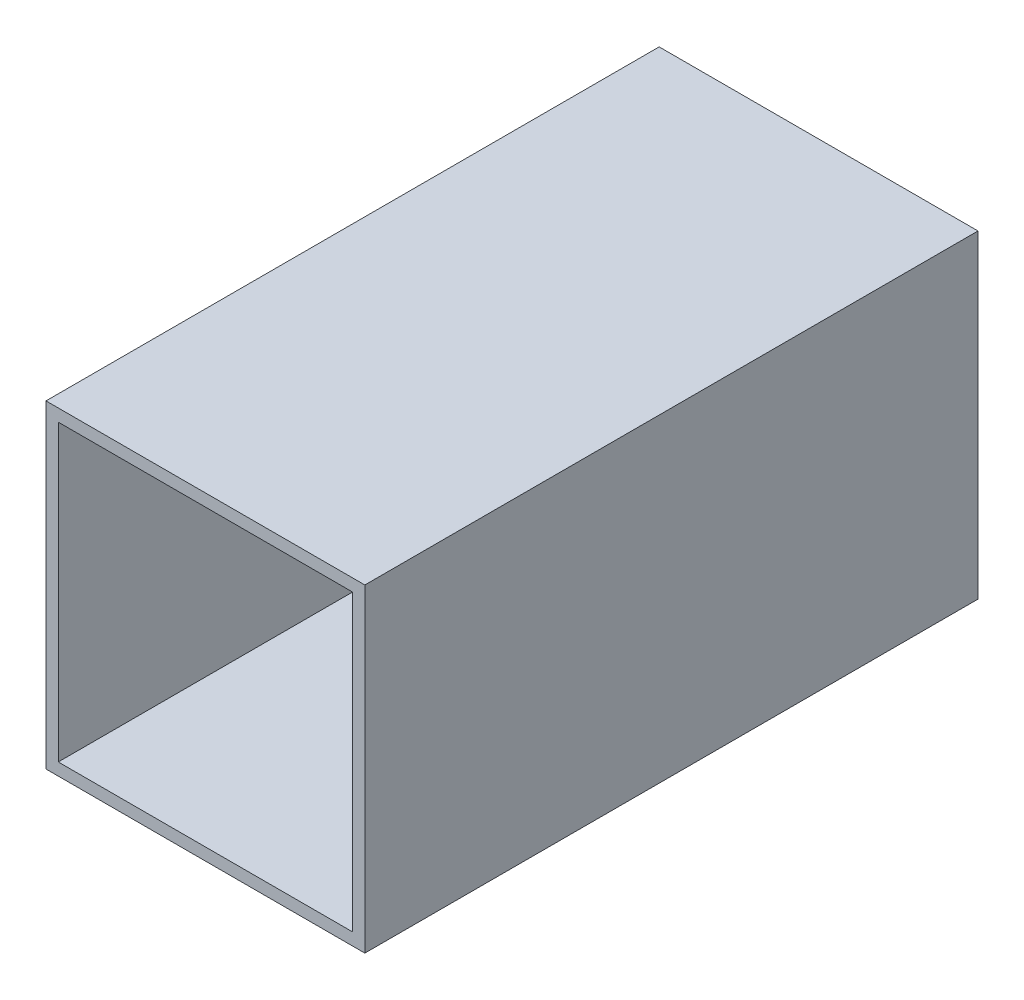
ISO-10303-21;
HEADER;
FILE_DESCRIPTION(('STEP AP214'),'2;1');
FILE_NAME('part.step','',(''),(''),'','','');
FILE_SCHEMA(('AUTOMOTIVE_DESIGN { 1 0 10303 214 1 1 1 1 }'));
ENDSEC;
DATA;
#1=APPLICATION_CONTEXT('core data for automotive mechanical design processes');
#2=APPLICATION_PROTOCOL_DEFINITION('international standard','automotive_design',2000,#1);
#3=PRODUCT_CONTEXT('',#1,'mechanical');
#4=PRODUCT('Part','Part','',(#3));
#5=PRODUCT_RELATED_PRODUCT_CATEGORY('part','',(#4));
#6=PRODUCT_DEFINITION_FORMATION('','',#4);
#7=PRODUCT_DEFINITION_CONTEXT('part definition',#1,'design');
#8=PRODUCT_DEFINITION('design','',#6,#7);
#9=PRODUCT_DEFINITION_SHAPE('','',#8);
#10=(LENGTH_UNIT() NAMED_UNIT(*) SI_UNIT(.MILLI.,.METRE.));
#11=(NAMED_UNIT(*) PLANE_ANGLE_UNIT() SI_UNIT($,.RADIAN.));
#12=(NAMED_UNIT(*) SI_UNIT($,.STERADIAN.) SOLID_ANGLE_UNIT());
#13=UNCERTAINTY_MEASURE_WITH_UNIT(LENGTH_MEASURE(1.E-05),#10,'distance_accuracy_value','');
#14=(GEOMETRIC_REPRESENTATION_CONTEXT(3) GLOBAL_UNCERTAINTY_ASSIGNED_CONTEXT((#13)) GLOBAL_UNIT_ASSIGNED_CONTEXT((#10,
#11,#12)) REPRESENTATION_CONTEXT('',''));
#15=CARTESIAN_POINT('',(0.,0.,0.));
#16=DIRECTION('',(0.,0.,1.));
#17=DIRECTION('',(1.,0.,0.));
#18=AXIS2_PLACEMENT_3D('',#15,#16,#17);
#19=CARTESIAN_POINT('',(0.,0.,152.4));
#20=DIRECTION('',(0.,0.,1.));
#21=DIRECTION('',(1.,0.,0.));
#22=AXIS2_PLACEMENT_3D('',#19,#20,#21);
#23=PLANE('',#22);
#24=DIRECTION('',(0.,-1.,0.));
#25=VECTOR('',#24,1.);
#26=CARTESIAN_POINT('',(-39.624,-39.624,152.4));
#27=LINE('',#26,#25);
#28=CARTESIAN_POINT('',(-39.624,39.624,152.4));
#29=VERTEX_POINT('',#28);
#30=CARTESIAN_POINT('',(-39.624,-39.624,152.4));
#31=VERTEX_POINT('',#30);
#32=EDGE_CURVE('E133',#29,#31,#27,.T.);
#33=ORIENTED_EDGE('',*,*,#32,.T.);
#34=DIRECTION('',(1.,0.,0.));
#35=VECTOR('',#34,1.);
#36=CARTESIAN_POINT('',(39.624,-39.624,152.4));
#37=LINE('',#36,#35);
#38=CARTESIAN_POINT('',(39.624,-39.624,152.4));
#39=VERTEX_POINT('',#38);
#40=EDGE_CURVE('E136',#31,#39,#37,.T.);
#41=ORIENTED_EDGE('',*,*,#40,.T.);
#42=DIRECTION('',(0.,1.,0.));
#43=VECTOR('',#42,1.);
#44=CARTESIAN_POINT('',(39.624,-39.624,152.4));
#45=LINE('',#44,#43);
#46=CARTESIAN_POINT('',(39.624,39.624,152.4));
#47=VERTEX_POINT('',#46);
#48=EDGE_CURVE('E139',#39,#47,#45,.T.);
#49=ORIENTED_EDGE('',*,*,#48,.T.);
#50=DIRECTION('',(-1.,0.,0.));
#51=VECTOR('',#50,1.);
#52=CARTESIAN_POINT('',(39.624,39.624,152.4));
#53=LINE('',#52,#51);
#54=EDGE_CURVE('E141',#47,#29,#53,.T.);
#55=ORIENTED_EDGE('',*,*,#54,.T.);
#56=EDGE_LOOP('',(#33,#41,#49,#55));
#57=FACE_BOUND('',#56,.T.);
#58=DIRECTION('',(-1.,0.,0.));
#59=VECTOR('',#58,1.);
#60=CARTESIAN_POINT('',(-36.576,36.576,152.4));
#61=LINE('',#60,#59);
#62=CARTESIAN_POINT('',(36.576,36.576,152.4));
#63=VERTEX_POINT('',#62);
#64=CARTESIAN_POINT('',(-36.576,36.576,152.4));
#65=VERTEX_POINT('',#64);
#66=EDGE_CURVE('E105',#63,#65,#61,.T.);
#67=ORIENTED_EDGE('',*,*,#66,.F.);
#68=DIRECTION('',(0.,1.,0.));
#69=VECTOR('',#68,1.);
#70=CARTESIAN_POINT('',(36.576,36.576,152.4));
#71=LINE('',#70,#69);
#72=CARTESIAN_POINT('',(36.5760000000001,-36.576,152.4));
#73=VERTEX_POINT('',#72);
#74=EDGE_CURVE('E97',#73,#63,#71,.T.);
#75=ORIENTED_EDGE('',*,*,#74,.F.);
#76=DIRECTION('',(1.,0.,0.));
#77=VECTOR('',#76,1.);
#78=CARTESIAN_POINT('',(-36.576,-36.576,152.4));
#79=LINE('',#78,#77);
#80=CARTESIAN_POINT('',(-36.576,-36.576,152.4));
#81=VERTEX_POINT('',#80);
#82=EDGE_CURVE('E119',#81,#73,#79,.T.);
#83=ORIENTED_EDGE('',*,*,#82,.F.);
#84=DIRECTION('',(0.,-1.,0.));
#85=VECTOR('',#84,1.);
#86=CARTESIAN_POINT('',(-36.576,36.576,152.4));
#87=LINE('',#86,#85);
#88=EDGE_CURVE('E117',#65,#81,#87,.T.);
#89=ORIENTED_EDGE('',*,*,#88,.F.);
#90=EDGE_LOOP('',(#67,#75,#83,#89));
#91=FACE_BOUND('',#90,.T.);
#92=ADVANCED_FACE('F32',(#57,#91),#23,.T.);
#93=CARTESIAN_POINT('',(0.,0.,0.));
#94=DIRECTION('',(0.,0.,1.));
#95=DIRECTION('',(1.,0.,0.));
#96=AXIS2_PLACEMENT_3D('',#93,#94,#95);
#97=PLANE('',#96);
#98=DIRECTION('',(0.,-1.,0.));
#99=VECTOR('',#98,1.);
#100=CARTESIAN_POINT('',(-39.624,-39.624,0.));
#101=LINE('',#100,#99);
#102=CARTESIAN_POINT('',(-39.624,39.624,0.));
#103=VERTEX_POINT('',#102);
#104=CARTESIAN_POINT('',(-39.624,-39.624,0.));
#105=VERTEX_POINT('',#104);
#106=EDGE_CURVE('E113',#103,#105,#101,.T.);
#107=ORIENTED_EDGE('',*,*,#106,.F.);
#108=DIRECTION('',(-1.,0.,0.));
#109=VECTOR('',#108,1.);
#110=CARTESIAN_POINT('',(39.624,39.624,0.));
#111=LINE('',#110,#109);
#112=CARTESIAN_POINT('',(39.624,39.624,0.));
#113=VERTEX_POINT('',#112);
#114=EDGE_CURVE('E137',#113,#103,#111,.T.);
#115=ORIENTED_EDGE('',*,*,#114,.F.);
#116=DIRECTION('',(0.,1.,0.));
#117=VECTOR('',#116,1.);
#118=CARTESIAN_POINT('',(39.624,-39.624,0.));
#119=LINE('',#118,#117);
#120=CARTESIAN_POINT('',(39.624,-39.624,0.));
#121=VERTEX_POINT('',#120);
#122=EDGE_CURVE('E148',#121,#113,#119,.T.);
#123=ORIENTED_EDGE('',*,*,#122,.F.);
#124=DIRECTION('',(1.,0.,0.));
#125=VECTOR('',#124,1.);
#126=CARTESIAN_POINT('',(39.624,-39.624,0.));
#127=LINE('',#126,#125);
#128=EDGE_CURVE('E146',#105,#121,#127,.T.);
#129=ORIENTED_EDGE('',*,*,#128,.F.);
#130=EDGE_LOOP('',(#107,#115,#123,#129));
#131=FACE_BOUND('',#130,.T.);
#132=DIRECTION('',(0.,1.,0.));
#133=VECTOR('',#132,1.);
#134=CARTESIAN_POINT('',(36.576,36.576,0.));
#135=LINE('',#134,#133);
#136=CARTESIAN_POINT('',(36.5760000000001,-36.576,0.));
#137=VERTEX_POINT('',#136);
#138=CARTESIAN_POINT('',(36.576,36.576,0.));
#139=VERTEX_POINT('',#138);
#140=EDGE_CURVE('E55',#137,#139,#135,.T.);
#141=ORIENTED_EDGE('',*,*,#140,.T.);
#142=DIRECTION('',(-1.,0.,0.));
#143=VECTOR('',#142,1.);
#144=CARTESIAN_POINT('',(-36.576,36.576,0.));
#145=LINE('',#144,#143);
#146=CARTESIAN_POINT('',(-36.576,36.576,0.));
#147=VERTEX_POINT('',#146);
#148=EDGE_CURVE('E112',#139,#147,#145,.T.);
#149=ORIENTED_EDGE('',*,*,#148,.T.);
#150=DIRECTION('',(0.,-1.,0.));
#151=VECTOR('',#150,1.);
#152=CARTESIAN_POINT('',(-36.576,36.576,0.));
#153=LINE('',#152,#151);
#154=CARTESIAN_POINT('',(-36.576,-36.576,0.));
#155=VERTEX_POINT('',#154);
#156=EDGE_CURVE('E125',#147,#155,#153,.T.);
#157=ORIENTED_EDGE('',*,*,#156,.T.);
#158=DIRECTION('',(1.,0.,0.));
#159=VECTOR('',#158,1.);
#160=CARTESIAN_POINT('',(-36.576,-36.576,0.));
#161=LINE('',#160,#159);
#162=EDGE_CURVE('E106',#155,#137,#161,.T.);
#163=ORIENTED_EDGE('',*,*,#162,.T.);
#164=EDGE_LOOP('',(#141,#149,#157,#163));
#165=FACE_BOUND('',#164,.T.);
#166=ADVANCED_FACE('F166',(#131,#165),#97,.F.);
#167=CARTESIAN_POINT('',(-39.624,-39.624,152.4));
#168=DIRECTION('',(1.,0.,0.));
#169=DIRECTION('',(0.,0.,-1.));
#170=AXIS2_PLACEMENT_3D('',#167,#168,#169);
#171=PLANE('',#170);
#172=ORIENTED_EDGE('',*,*,#106,.T.);
#173=DIRECTION('',(0.,0.,-1.));
#174=VECTOR('',#173,1.);
#175=CARTESIAN_POINT('',(-39.624,-39.624,152.4));
#176=LINE('',#175,#174);
#177=EDGE_CURVE('E11',#31,#105,#176,.T.);
#178=ORIENTED_EDGE('',*,*,#177,.F.);
#179=ORIENTED_EDGE('',*,*,#32,.F.);
#180=DIRECTION('',(0.,0.,-1.));
#181=VECTOR('',#180,1.);
#182=CARTESIAN_POINT('',(-39.624,39.624,152.4));
#183=LINE('',#182,#181);
#184=EDGE_CURVE('E143',#29,#103,#183,.T.);
#185=ORIENTED_EDGE('',*,*,#184,.T.);
#186=EDGE_LOOP('',(#172,#178,#179,#185));
#187=FACE_BOUND('',#186,.T.);
#188=ADVANCED_FACE('F34',(#187),#171,.F.);
#189=CARTESIAN_POINT('',(39.624,-39.624,152.4));
#190=DIRECTION('',(0.,1.,0.));
#191=DIRECTION('',(0.,0.,1.));
#192=AXIS2_PLACEMENT_3D('',#189,#190,#191);
#193=PLANE('',#192);
#194=ORIENTED_EDGE('',*,*,#128,.T.);
#195=DIRECTION('',(0.,0.,-1.));
#196=VECTOR('',#195,1.);
#197=CARTESIAN_POINT('',(39.624,-39.624,152.4));
#198=LINE('',#197,#196);
#199=EDGE_CURVE('E40',#39,#121,#198,.T.);
#200=ORIENTED_EDGE('',*,*,#199,.F.);
#201=ORIENTED_EDGE('',*,*,#40,.F.);
#202=ORIENTED_EDGE('',*,*,#177,.T.);
#203=EDGE_LOOP('',(#194,#200,#201,#202));
#204=FACE_BOUND('',#203,.T.);
#205=ADVANCED_FACE('F176',(#204),#193,.F.);
#206=CARTESIAN_POINT('',(39.624,-39.624,152.4));
#207=DIRECTION('',(-1.,0.,0.));
#208=DIRECTION('',(0.,0.,1.));
#209=AXIS2_PLACEMENT_3D('',#206,#207,#208);
#210=PLANE('',#209);
#211=ORIENTED_EDGE('',*,*,#122,.T.);
#212=DIRECTION('',(0.,0.,-1.));
#213=VECTOR('',#212,1.);
#214=CARTESIAN_POINT('',(39.624,39.624,152.4));
#215=LINE('',#214,#213);
#216=EDGE_CURVE('E153',#47,#113,#215,.T.);
#217=ORIENTED_EDGE('',*,*,#216,.F.);
#218=ORIENTED_EDGE('',*,*,#48,.F.);
#219=ORIENTED_EDGE('',*,*,#199,.T.);
#220=EDGE_LOOP('',(#211,#217,#218,#219));
#221=FACE_BOUND('',#220,.T.);
#222=ADVANCED_FACE('F160',(#221),#210,.F.);
#223=CARTESIAN_POINT('',(39.624,39.624,152.4));
#224=DIRECTION('',(0.,-1.,0.));
#225=DIRECTION('',(0.,0.,-1.));
#226=AXIS2_PLACEMENT_3D('',#223,#224,#225);
#227=PLANE('',#226);
#228=ORIENTED_EDGE('',*,*,#114,.T.);
#229=ORIENTED_EDGE('',*,*,#184,.F.);
#230=ORIENTED_EDGE('',*,*,#54,.F.);
#231=ORIENTED_EDGE('',*,*,#216,.T.);
#232=EDGE_LOOP('',(#228,#229,#230,#231));
#233=FACE_BOUND('',#232,.T.);
#234=ADVANCED_FACE('F170',(#233),#227,.F.);
#235=CARTESIAN_POINT('',(36.576,36.576,152.4));
#236=DIRECTION('',(-1.,0.,0.));
#237=DIRECTION('',(0.,-1.,0.));
#238=AXIS2_PLACEMENT_3D('',#235,#236,#237);
#239=PLANE('',#238);
#240=ORIENTED_EDGE('',*,*,#140,.F.);
#241=DIRECTION('',(0.,0.,-1.));
#242=VECTOR('',#241,1.);
#243=CARTESIAN_POINT('',(36.5760000000001,-36.576,152.4));
#244=LINE('',#243,#242);
#245=EDGE_CURVE('E101',#73,#137,#244,.T.);
#246=ORIENTED_EDGE('',*,*,#245,.F.);
#247=ORIENTED_EDGE('',*,*,#74,.T.);
#248=DIRECTION('',(0.,0.,-1.));
#249=VECTOR('',#248,1.);
#250=CARTESIAN_POINT('',(36.576,36.576,152.4));
#251=LINE('',#250,#249);
#252=EDGE_CURVE('E100',#63,#139,#251,.T.);
#253=ORIENTED_EDGE('',*,*,#252,.T.);
#254=EDGE_LOOP('',(#240,#246,#247,#253));
#255=FACE_BOUND('',#254,.T.);
#256=ADVANCED_FACE('F99',(#255),#239,.T.);
#257=CARTESIAN_POINT('',(-36.576,36.576,152.4));
#258=DIRECTION('',(0.,-1.,0.));
#259=DIRECTION('',(0.,0.,-1.));
#260=AXIS2_PLACEMENT_3D('',#257,#258,#259);
#261=PLANE('',#260);
#262=ORIENTED_EDGE('',*,*,#148,.F.);
#263=ORIENTED_EDGE('',*,*,#252,.F.);
#264=ORIENTED_EDGE('',*,*,#66,.T.);
#265=DIRECTION('',(0.,0.,-1.));
#266=VECTOR('',#265,1.);
#267=CARTESIAN_POINT('',(-36.576,36.576,152.4));
#268=LINE('',#267,#266);
#269=EDGE_CURVE('E114',#65,#147,#268,.T.);
#270=ORIENTED_EDGE('',*,*,#269,.T.);
#271=EDGE_LOOP('',(#262,#263,#264,#270));
#272=FACE_BOUND('',#271,.T.);
#273=ADVANCED_FACE('F109',(#272),#261,.T.);
#274=CARTESIAN_POINT('',(-36.576,36.576,152.4));
#275=DIRECTION('',(1.,0.,0.));
#276=DIRECTION('',(0.,1.,0.));
#277=AXIS2_PLACEMENT_3D('',#274,#275,#276);
#278=PLANE('',#277);
#279=ORIENTED_EDGE('',*,*,#156,.F.);
#280=ORIENTED_EDGE('',*,*,#269,.F.);
#281=ORIENTED_EDGE('',*,*,#88,.T.);
#282=DIRECTION('',(0.,0.,-1.));
#283=VECTOR('',#282,1.);
#284=CARTESIAN_POINT('',(-36.576,-36.576,152.4));
#285=LINE('',#284,#283);
#286=EDGE_CURVE('E47',#81,#155,#285,.T.);
#287=ORIENTED_EDGE('',*,*,#286,.T.);
#288=EDGE_LOOP('',(#279,#280,#281,#287));
#289=FACE_BOUND('',#288,.T.);
#290=ADVANCED_FACE('F199',(#289),#278,.T.);
#291=CARTESIAN_POINT('',(-36.576,-36.576,152.4));
#292=DIRECTION('',(0.,1.,0.));
#293=DIRECTION('',(-1.,0.,0.));
#294=AXIS2_PLACEMENT_3D('',#291,#292,#293);
#295=PLANE('',#294);
#296=ORIENTED_EDGE('',*,*,#162,.F.);
#297=ORIENTED_EDGE('',*,*,#286,.F.);
#298=ORIENTED_EDGE('',*,*,#82,.T.);
#299=ORIENTED_EDGE('',*,*,#245,.T.);
#300=EDGE_LOOP('',(#296,#297,#298,#299));
#301=FACE_BOUND('',#300,.T.);
#302=ADVANCED_FACE('F203',(#301),#295,.T.);
#303=CLOSED_SHELL('',(#92,#166,#188,#205,#222,#234,#256,#273,#290,#302));
#304=MANIFOLD_SOLID_BREP('B2',#303);
#305=ADVANCED_BREP_SHAPE_REPRESENTATION('',(#18,#304),#14);
#306=SHAPE_DEFINITION_REPRESENTATION(#9,#305);
ENDSEC;
END-ISO-10303-21;
